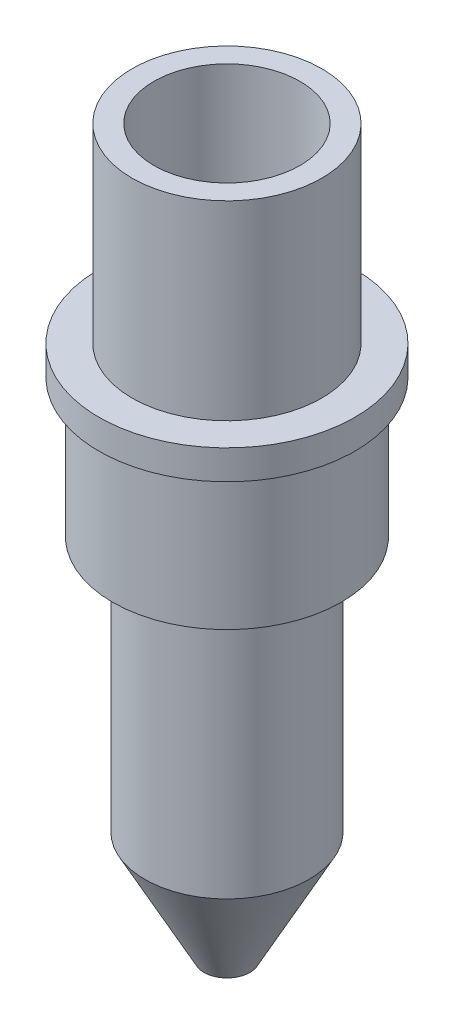
ISO-10303-21;
HEADER;
FILE_DESCRIPTION(('STEP AP214'),'2;1');
FILE_NAME('part.step','',(''),(''),'','','');
FILE_SCHEMA(('AUTOMOTIVE_DESIGN { 1 0 10303 214 1 1 1 1 }'));
ENDSEC;
DATA;
#1=APPLICATION_CONTEXT('core data for automotive mechanical design processes');
#2=APPLICATION_PROTOCOL_DEFINITION('international standard','automotive_design',2000,#1);
#3=PRODUCT_CONTEXT('',#1,'mechanical');
#4=PRODUCT('Part','Part','',(#3));
#5=PRODUCT_RELATED_PRODUCT_CATEGORY('part','',(#4));
#6=PRODUCT_DEFINITION_FORMATION('','',#4);
#7=PRODUCT_DEFINITION_CONTEXT('part definition',#1,'design');
#8=PRODUCT_DEFINITION('design','',#6,#7);
#9=PRODUCT_DEFINITION_SHAPE('','',#8);
#10=(LENGTH_UNIT() NAMED_UNIT(*) SI_UNIT(.MILLI.,.METRE.));
#11=(NAMED_UNIT(*) PLANE_ANGLE_UNIT() SI_UNIT($,.RADIAN.));
#12=(NAMED_UNIT(*) SI_UNIT($,.STERADIAN.) SOLID_ANGLE_UNIT());
#13=UNCERTAINTY_MEASURE_WITH_UNIT(LENGTH_MEASURE(1.E-05),#10,'distance_accuracy_value','');
#14=(GEOMETRIC_REPRESENTATION_CONTEXT(3) GLOBAL_UNCERTAINTY_ASSIGNED_CONTEXT((#13)) GLOBAL_UNIT_ASSIGNED_CONTEXT((#10,
#11,#12)) REPRESENTATION_CONTEXT('',''));
#15=CARTESIAN_POINT('',(0.,0.,0.));
#16=DIRECTION('',(0.,0.,1.));
#17=DIRECTION('',(1.,0.,0.));
#18=AXIS2_PLACEMENT_3D('',#15,#16,#17);
#19=CARTESIAN_POINT('',(0.,20.74,0.));
#20=DIRECTION('',(0.,-1.,0.));
#21=DIRECTION('',(0.,0.,-1.));
#22=AXIS2_PLACEMENT_3D('',#19,#20,#21);
#23=CYLINDRICAL_SURFACE('',#22,2.45);
#24=CARTESIAN_POINT('',(0.,-58.08,0.));
#25=DIRECTION('',(0.,-1.,0.));
#26=DIRECTION('',(0.,0.,-1.));
#27=AXIS2_PLACEMENT_3D('',#24,#25,#26);
#28=CIRCLE('',#27,2.45);
#29=CARTESIAN_POINT('',(0.,-58.08,-2.45));
#30=VERTEX_POINT('',#29);
#31=EDGE_CURVE('E273',#30,#30,#28,.T.);
#32=ORIENTED_EDGE('',*,*,#31,.T.);
#33=EDGE_LOOP('',(#32));
#34=FACE_BOUND('',#33,.T.);
#35=CARTESIAN_POINT('',(0.,-46.,0.));
#36=DIRECTION('',(0.,1.,0.));
#37=DIRECTION('',(0.,0.,1.));
#38=AXIS2_PLACEMENT_3D('',#35,#36,#37);
#39=CIRCLE('',#38,2.45);
#40=CARTESIAN_POINT('',(0.,-46.,2.45));
#41=VERTEX_POINT('',#40);
#42=EDGE_CURVE('E36',#41,#41,#39,.F.);
#43=ORIENTED_EDGE('',*,*,#42,.F.);
#44=EDGE_LOOP('',(#43));
#45=FACE_BOUND('',#44,.T.);
#46=ADVANCED_FACE('F32',(#34,#45),#23,.F.);
#47=CARTESIAN_POINT('',(0.,20.74,0.));
#48=DIRECTION('',(0.,1.,0.));
#49=DIRECTION('',(0.,0.,1.));
#50=AXIS2_PLACEMENT_3D('',#47,#48,#49);
#51=PLANE('',#50);
#52=CARTESIAN_POINT('',(0.,20.74,0.));
#53=DIRECTION('',(0.,1.,0.));
#54=DIRECTION('',(0.,0.,1.));
#55=AXIS2_PLACEMENT_3D('',#52,#53,#54);
#56=CIRCLE('',#55,10.33);
#57=CARTESIAN_POINT('',(0.,20.74,10.33));
#58=VERTEX_POINT('',#57);
#59=EDGE_CURVE('E45',#58,#58,#56,.T.);
#60=ORIENTED_EDGE('',*,*,#59,.T.);
#61=EDGE_LOOP('',(#60));
#62=FACE_BOUND('',#61,.T.);
#63=CARTESIAN_POINT('',(0.,20.74,0.));
#64=DIRECTION('',(0.,1.,0.));
#65=DIRECTION('',(0.,0.,1.));
#66=AXIS2_PLACEMENT_3D('',#63,#64,#65);
#67=CIRCLE('',#66,7.95);
#68=CARTESIAN_POINT('',(0.,20.74,7.95));
#69=VERTEX_POINT('',#68);
#70=EDGE_CURVE('E61',#69,#69,#67,.T.);
#71=ORIENTED_EDGE('',*,*,#70,.F.);
#72=EDGE_LOOP('',(#71));
#73=FACE_BOUND('',#72,.T.);
#74=ADVANCED_FACE('F96',(#62,#73),#51,.T.);
#75=CARTESIAN_POINT('',(0.,20.74,0.));
#76=DIRECTION('',(0.,-1.,0.));
#77=DIRECTION('',(0.,0.,-1.));
#78=AXIS2_PLACEMENT_3D('',#75,#76,#77);
#79=CYLINDRICAL_SURFACE('',#78,10.33);
#80=ORIENTED_EDGE('',*,*,#59,.F.);
#81=EDGE_LOOP('',(#80));
#82=FACE_BOUND('',#81,.T.);
#83=CARTESIAN_POINT('',(0.,0.,0.));
#84=DIRECTION('',(0.,1.,0.));
#85=DIRECTION('',(0.,0.,1.));
#86=AXIS2_PLACEMENT_3D('',#83,#84,#85);
#87=CIRCLE('',#86,10.33);
#88=CARTESIAN_POINT('',(0.,0.,10.33));
#89=VERTEX_POINT('',#88);
#90=EDGE_CURVE('E58',#89,#89,#87,.T.);
#91=ORIENTED_EDGE('',*,*,#90,.T.);
#92=EDGE_LOOP('',(#91));
#93=FACE_BOUND('',#92,.T.);
#94=ADVANCED_FACE('F34',(#82,#93),#79,.T.);
#95=CARTESIAN_POINT('',(0.,20.74,0.));
#96=DIRECTION('',(0.,-1.,0.));
#97=DIRECTION('',(0.,0.,-1.));
#98=AXIS2_PLACEMENT_3D('',#95,#96,#97);
#99=CYLINDRICAL_SURFACE('',#98,7.95);
#100=ORIENTED_EDGE('',*,*,#70,.T.);
#101=EDGE_LOOP('',(#100));
#102=FACE_BOUND('',#101,.T.);
#103=CARTESIAN_POINT('',(0.,0.,0.));
#104=DIRECTION('',(0.,1.,0.));
#105=DIRECTION('',(0.,0.,1.));
#106=AXIS2_PLACEMENT_3D('',#103,#104,#105);
#107=CIRCLE('',#106,7.95);
#108=CARTESIAN_POINT('',(0.,0.,7.95));
#109=VERTEX_POINT('',#108);
#110=EDGE_CURVE('E64',#109,#109,#107,.T.);
#111=ORIENTED_EDGE('',*,*,#110,.F.);
#112=EDGE_LOOP('',(#111));
#113=FACE_BOUND('',#112,.T.);
#114=ADVANCED_FACE('F91',(#102,#113),#99,.F.);
#115=CARTESIAN_POINT('',(0.,0.,0.));
#116=DIRECTION('',(0.,-1.,0.));
#117=DIRECTION('',(0.,0.,-1.));
#118=AXIS2_PLACEMENT_3D('',#115,#116,#117);
#119=PLANE('',#118);
#120=CARTESIAN_POINT('',(0.,0.,0.));
#121=DIRECTION('',(0.,1.,0.));
#122=DIRECTION('',(0.,0.,1.));
#123=AXIS2_PLACEMENT_3D('',#120,#121,#122);
#124=CIRCLE('',#123,5.5);
#125=CARTESIAN_POINT('',(0.,0.,5.5));
#126=VERTEX_POINT('',#125);
#127=EDGE_CURVE('E269',#126,#126,#124,.T.);
#128=ORIENTED_EDGE('',*,*,#127,.F.);
#129=EDGE_LOOP('',(#128));
#130=FACE_BOUND('',#129,.T.);
#131=ORIENTED_EDGE('',*,*,#110,.T.);
#132=EDGE_LOOP('',(#131));
#133=FACE_BOUND('',#132,.T.);
#134=ADVANCED_FACE('F78',(#130,#133),#119,.F.);
#135=CARTESIAN_POINT('',(0.,-3.2,0.));
#136=DIRECTION('',(0.,1.,0.));
#137=DIRECTION('',(0.,0.,1.));
#138=AXIS2_PLACEMENT_3D('',#135,#136,#137);
#139=CYLINDRICAL_SURFACE('',#138,13.94);
#140=CARTESIAN_POINT('',(0.,-3.2,0.));
#141=DIRECTION('',(0.,-1.,0.));
#142=DIRECTION('',(0.,0.,-1.));
#143=AXIS2_PLACEMENT_3D('',#140,#141,#142);
#144=CIRCLE('',#143,13.94);
#145=CARTESIAN_POINT('',(0.,-3.2,-13.94));
#146=VERTEX_POINT('',#145);
#147=EDGE_CURVE('E55',#146,#146,#144,.T.);
#148=ORIENTED_EDGE('',*,*,#147,.F.);
#149=EDGE_LOOP('',(#148));
#150=FACE_BOUND('',#149,.T.);
#151=CARTESIAN_POINT('',(0.,0.,0.));
#152=DIRECTION('',(0.,-1.,0.));
#153=DIRECTION('',(0.,0.,-1.));
#154=AXIS2_PLACEMENT_3D('',#151,#152,#153);
#155=CIRCLE('',#154,13.94);
#156=CARTESIAN_POINT('',(0.,0.,-13.94));
#157=VERTEX_POINT('',#156);
#158=EDGE_CURVE('E53',#157,#157,#155,.T.);
#159=ORIENTED_EDGE('',*,*,#158,.T.);
#160=EDGE_LOOP('',(#159));
#161=FACE_BOUND('',#160,.T.);
#162=ADVANCED_FACE('F81',(#150,#161),#139,.T.);
#163=CARTESIAN_POINT('',(0.,-3.2,0.));
#164=DIRECTION('',(0.,-1.,0.));
#165=DIRECTION('',(0.,0.,-1.));
#166=AXIS2_PLACEMENT_3D('',#163,#164,#165);
#167=PLANE('',#166);
#168=CARTESIAN_POINT('',(0.,-3.2,0.));
#169=DIRECTION('',(0.,-1.,0.));
#170=DIRECTION('',(0.,0.,-1.));
#171=AXIS2_PLACEMENT_3D('',#168,#169,#170);
#172=CIRCLE('',#171,12.44);
#173=CARTESIAN_POINT('',(0.,-3.2,-12.44));
#174=VERTEX_POINT('',#173);
#175=EDGE_CURVE('E40',#174,#174,#172,.T.);
#176=ORIENTED_EDGE('',*,*,#175,.F.);
#177=EDGE_LOOP('',(#176));
#178=FACE_BOUND('',#177,.T.);
#179=ORIENTED_EDGE('',*,*,#147,.T.);
#180=EDGE_LOOP('',(#179));
#181=FACE_BOUND('',#180,.T.);
#182=ADVANCED_FACE('F76',(#178,#181),#167,.T.);
#183=ORIENTED_EDGE('',*,*,#90,.F.);
#184=EDGE_LOOP('',(#183));
#185=FACE_BOUND('',#184,.T.);
#186=ORIENTED_EDGE('',*,*,#158,.F.);
#187=EDGE_LOOP('',(#186));
#188=FACE_BOUND('',#187,.T.);
#189=ADVANCED_FACE('F72',(#185,#188),#119,.F.);
#190=CARTESIAN_POINT('',(0.,-18.2,0.));
#191=DIRECTION('',(0.,1.,0.));
#192=DIRECTION('',(0.,0.,1.));
#193=AXIS2_PLACEMENT_3D('',#190,#191,#192);
#194=CYLINDRICAL_SURFACE('',#193,12.44);
#195=CARTESIAN_POINT('',(0.,-18.2,0.));
#196=DIRECTION('',(0.,-1.,0.));
#197=DIRECTION('',(0.,0.,-1.));
#198=AXIS2_PLACEMENT_3D('',#195,#196,#197);
#199=CIRCLE('',#198,12.44);
#200=CARTESIAN_POINT('',(0.,-18.2,-12.44));
#201=VERTEX_POINT('',#200);
#202=EDGE_CURVE('E51',#201,#201,#199,.T.);
#203=ORIENTED_EDGE('',*,*,#202,.F.);
#204=EDGE_LOOP('',(#203));
#205=FACE_BOUND('',#204,.T.);
#206=ORIENTED_EDGE('',*,*,#175,.T.);
#207=EDGE_LOOP('',(#206));
#208=FACE_BOUND('',#207,.T.);
#209=ADVANCED_FACE('F75',(#205,#208),#194,.T.);
#210=CARTESIAN_POINT('',(0.,-18.2,0.));
#211=DIRECTION('',(0.,-1.,0.));
#212=DIRECTION('',(0.,0.,-1.));
#213=AXIS2_PLACEMENT_3D('',#210,#211,#212);
#214=PLANE('',#213);
#215=CARTESIAN_POINT('',(0.,-18.2,0.));
#216=DIRECTION('',(0.,-1.,0.));
#217=DIRECTION('',(0.,0.,-1.));
#218=AXIS2_PLACEMENT_3D('',#215,#216,#217);
#219=CIRCLE('',#218,8.94);
#220=CARTESIAN_POINT('',(0.,-18.2,-8.94));
#221=VERTEX_POINT('',#220);
#222=EDGE_CURVE('E10',#221,#221,#219,.T.);
#223=ORIENTED_EDGE('',*,*,#222,.F.);
#224=EDGE_LOOP('',(#223));
#225=FACE_BOUND('',#224,.T.);
#226=ORIENTED_EDGE('',*,*,#202,.T.);
#227=EDGE_LOOP('',(#226));
#228=FACE_BOUND('',#227,.T.);
#229=ADVANCED_FACE('F121',(#225,#228),#214,.T.);
#230=CARTESIAN_POINT('',(0.,-58.08,0.));
#231=DIRECTION('',(0.,1.,0.));
#232=DIRECTION('',(0.,0.,1.));
#233=AXIS2_PLACEMENT_3D('',#230,#231,#232);
#234=CYLINDRICAL_SURFACE('',#233,8.94);
#235=CARTESIAN_POINT('',(0.,-46.08,0.));
#236=DIRECTION('',(0.,-1.,0.));
#237=DIRECTION('',(0.,0.,-1.));
#238=AXIS2_PLACEMENT_3D('',#235,#236,#237);
#239=CIRCLE('',#238,8.94);
#240=CARTESIAN_POINT('',(0.,-46.08,-8.94));
#241=VERTEX_POINT('',#240);
#242=EDGE_CURVE('E274',#241,#241,#239,.T.);
#243=ORIENTED_EDGE('',*,*,#242,.F.);
#244=EDGE_LOOP('',(#243));
#245=FACE_BOUND('',#244,.T.);
#246=ORIENTED_EDGE('',*,*,#222,.T.);
#247=EDGE_LOOP('',(#246));
#248=FACE_BOUND('',#247,.T.);
#249=ADVANCED_FACE('F113',(#245,#248),#234,.T.);
#250=CARTESIAN_POINT('',(0.,-46.08,0.));
#251=DIRECTION('',(0.,1.,0.));
#252=DIRECTION('',(0.,0.,1.));
#253=AXIS2_PLACEMENT_3D('',#250,#251,#252);
#254=CONICAL_SURFACE('',#253,8.94,0.492548889214854);
#255=CARTESIAN_POINT('',(0.,-58.08,0.));
#256=DIRECTION('',(0.,-1.,0.));
#257=DIRECTION('',(0.,0.,-1.));
#258=AXIS2_PLACEMENT_3D('',#255,#256,#257);
#259=CIRCLE('',#258,2.5);
#260=CARTESIAN_POINT('',(0.,-58.08,-2.5));
#261=VERTEX_POINT('',#260);
#262=EDGE_CURVE('E49',#261,#261,#259,.T.);
#263=ORIENTED_EDGE('',*,*,#262,.F.);
#264=EDGE_LOOP('',(#263));
#265=FACE_BOUND('',#264,.T.);
#266=ORIENTED_EDGE('',*,*,#242,.T.);
#267=EDGE_LOOP('',(#266));
#268=FACE_BOUND('',#267,.T.);
#269=ADVANCED_FACE('F109',(#265,#268),#254,.T.);
#270=CARTESIAN_POINT('',(0.,-58.08,0.));
#271=DIRECTION('',(0.,-1.,0.));
#272=DIRECTION('',(0.,0.,-1.));
#273=AXIS2_PLACEMENT_3D('',#270,#271,#272);
#274=PLANE('',#273);
#275=ORIENTED_EDGE('',*,*,#31,.F.);
#276=EDGE_LOOP('',(#275));
#277=FACE_BOUND('',#276,.T.);
#278=ORIENTED_EDGE('',*,*,#262,.T.);
#279=EDGE_LOOP('',(#278));
#280=FACE_BOUND('',#279,.T.);
#281=ADVANCED_FACE('F112',(#277,#280),#274,.T.);
#282=CARTESIAN_POINT('',(0.,-46.,0.));
#283=DIRECTION('',(0.,1.,0.));
#284=DIRECTION('',(0.,0.,1.));
#285=AXIS2_PLACEMENT_3D('',#282,#283,#284);
#286=PLANE('',#285);
#287=CARTESIAN_POINT('',(0.,-46.,0.));
#288=DIRECTION('',(0.,1.,0.));
#289=DIRECTION('',(0.,0.,1.));
#290=AXIS2_PLACEMENT_3D('',#287,#288,#289);
#291=CIRCLE('',#290,5.5);
#292=CARTESIAN_POINT('',(0.,-46.,5.5));
#293=VERTEX_POINT('',#292);
#294=EDGE_CURVE('E266',#293,#293,#291,.T.);
#295=ORIENTED_EDGE('',*,*,#294,.T.);
#296=EDGE_LOOP('',(#295));
#297=FACE_BOUND('',#296,.T.);
#298=ORIENTED_EDGE('',*,*,#42,.T.);
#299=EDGE_LOOP('',(#298));
#300=FACE_BOUND('',#299,.T.);
#301=ADVANCED_FACE('F117',(#297,#300),#286,.T.);
#302=CARTESIAN_POINT('',(0.,-46.,0.));
#303=DIRECTION('',(0.,1.,0.));
#304=DIRECTION('',(0.,0.,1.));
#305=AXIS2_PLACEMENT_3D('',#302,#303,#304);
#306=CYLINDRICAL_SURFACE('',#305,5.5);
#307=ORIENTED_EDGE('',*,*,#294,.F.);
#308=EDGE_LOOP('',(#307));
#309=FACE_BOUND('',#308,.T.);
#310=ORIENTED_EDGE('',*,*,#127,.T.);
#311=EDGE_LOOP('',(#310));
#312=FACE_BOUND('',#311,.T.);
#313=ADVANCED_FACE('F107',(#309,#312),#306,.F.);
#314=CLOSED_SHELL('',(#46,#74,#94,#114,#134,#162,#182,#189,#209,#229,#249,#269,#281,#301,#313));
#315=MANIFOLD_SOLID_BREP('B2',#314);
#316=ADVANCED_BREP_SHAPE_REPRESENTATION('',(#18,#315),#14);
#317=SHAPE_DEFINITION_REPRESENTATION(#9,#316);
ENDSEC;
END-ISO-10303-21;
